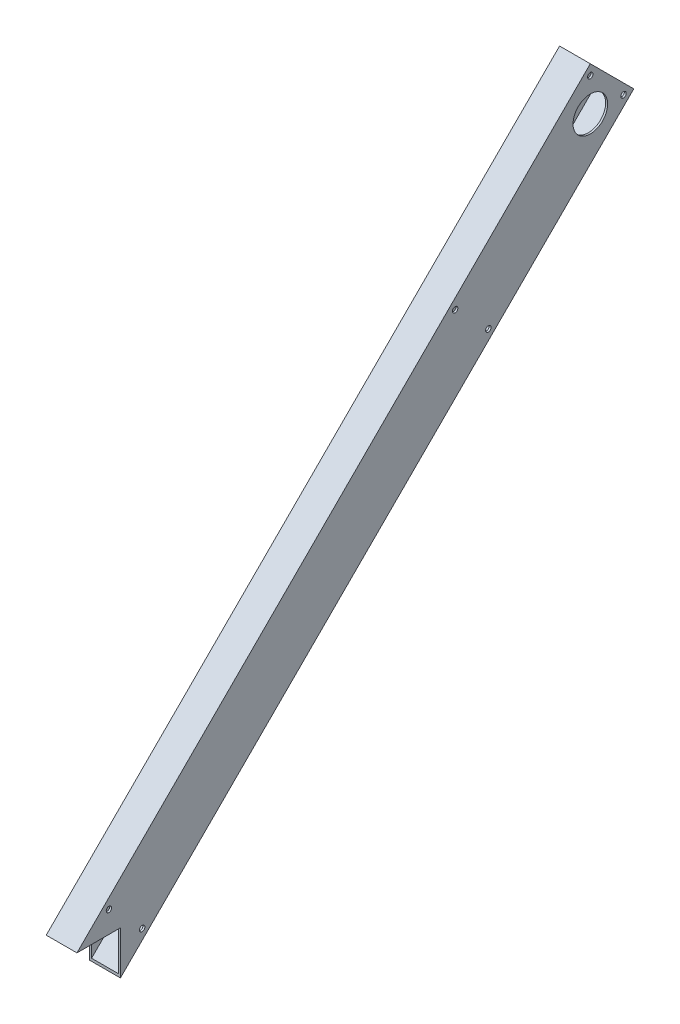
ISO-10303-21;
HEADER;
FILE_DESCRIPTION(('STEP AP214'),'2;1');
FILE_NAME('part.step','',(''),(''),'','','');
FILE_SCHEMA(('AUTOMOTIVE_DESIGN { 1 0 10303 214 1 1 1 1 }'));
ENDSEC;
DATA;
#1=APPLICATION_CONTEXT('core data for automotive mechanical design processes');
#2=APPLICATION_PROTOCOL_DEFINITION('international standard','automotive_design',2000,#1);
#3=PRODUCT_CONTEXT('',#1,'mechanical');
#4=PRODUCT('Part','Part','',(#3));
#5=PRODUCT_RELATED_PRODUCT_CATEGORY('part','',(#4));
#6=PRODUCT_DEFINITION_FORMATION('','',#4);
#7=PRODUCT_DEFINITION_CONTEXT('part definition',#1,'design');
#8=PRODUCT_DEFINITION('design','',#6,#7);
#9=PRODUCT_DEFINITION_SHAPE('','',#8);
#10=(LENGTH_UNIT() NAMED_UNIT(*) SI_UNIT(.MILLI.,.METRE.));
#11=(NAMED_UNIT(*) PLANE_ANGLE_UNIT() SI_UNIT($,.RADIAN.));
#12=(NAMED_UNIT(*) SI_UNIT($,.STERADIAN.) SOLID_ANGLE_UNIT());
#13=UNCERTAINTY_MEASURE_WITH_UNIT(LENGTH_MEASURE(1.E-05),#10,'distance_accuracy_value','');
#14=(GEOMETRIC_REPRESENTATION_CONTEXT(3) GLOBAL_UNCERTAINTY_ASSIGNED_CONTEXT((#13)) GLOBAL_UNIT_ASSIGNED_CONTEXT((#10,
#11,#12)) REPRESENTATION_CONTEXT('',''));
#15=CARTESIAN_POINT('',(0.,0.,0.));
#16=DIRECTION('',(0.,0.,1.));
#17=DIRECTION('',(1.,0.,0.));
#18=AXIS2_PLACEMENT_3D('',#15,#16,#17);
#19=CARTESIAN_POINT('',(101.6,25.3999999999999,-118.678975515723));
#20=DIRECTION('',(1.,0.,0.));
#21=DIRECTION('',(0.,1.,0.));
#22=AXIS2_PLACEMENT_3D('',#19,#20,#21);
#23=PLANE('',#22);
#24=CARTESIAN_POINT('',(101.6,302.020172800175,-458.655915910218));
#25=DIRECTION('',(1.,0.,0.));
#26=DIRECTION('',(0.,1.,0.));
#27=AXIS2_PLACEMENT_3D('',#24,#25,#26);
#28=CIRCLE('',#27,2.25000000000001);
#29=CARTESIAN_POINT('',(101.6,304.270172800175,-458.655915910218));
#30=VERTEX_POINT('',#29);
#31=EDGE_CURVE('E137',#30,#30,#28,.T.);
#32=ORIENTED_EDGE('',*,*,#31,.F.);
#33=EDGE_LOOP('',(#32));
#34=FACE_BOUND('',#33,.T.);
#35=CARTESIAN_POINT('',(101.6,329.455915910215,-431.220172800177));
#36=DIRECTION('',(1.,0.,0.));
#37=DIRECTION('',(0.,1.,0.));
#38=AXIS2_PLACEMENT_3D('',#35,#36,#37);
#39=CIRCLE('',#38,2.25000000000001);
#40=CARTESIAN_POINT('',(101.6,331.705915910215,-431.220172800177));
#41=VERTEX_POINT('',#40);
#42=EDGE_CURVE('E140',#41,#41,#39,.T.);
#43=ORIENTED_EDGE('',*,*,#42,.F.);
#44=EDGE_LOOP('',(#43));
#45=FACE_BOUND('',#44,.T.);
#46=CARTESIAN_POINT('',(101.6,413.74304422765,-570.378787337692));
#47=DIRECTION('',(1.,0.,0.));
#48=DIRECTION('',(0.,1.,0.));
#49=AXIS2_PLACEMENT_3D('',#46,#47,#48);
#50=CIRCLE('',#49,2.25000000000001);
#51=CARTESIAN_POINT('',(101.6,415.99304422765,-570.378787337692));
#52=VERTEX_POINT('',#51);
#53=EDGE_CURVE('E300',#52,#52,#50,.T.);
#54=ORIENTED_EDGE('',*,*,#53,.F.);
#55=EDGE_LOOP('',(#54));
#56=FACE_BOUND('',#55,.T.);
#57=CARTESIAN_POINT('',(101.6,441.17878733769,-542.943044227652));
#58=DIRECTION('',(1.,0.,0.));
#59=DIRECTION('',(0.,1.,0.));
#60=AXIS2_PLACEMENT_3D('',#57,#58,#59);
#61=CIRCLE('',#60,2.25000000000001);
#62=CARTESIAN_POINT('',(101.6,443.42878733769,-542.943044227652));
#63=VERTEX_POINT('',#62);
#64=EDGE_CURVE('E143',#63,#63,#61,.T.);
#65=ORIENTED_EDGE('',*,*,#64,.F.);
#66=EDGE_LOOP('',(#65));
#67=FACE_BOUND('',#66,.T.);
#68=CARTESIAN_POINT('',(101.6,413.74304422765,-542.943044227654));
#69=DIRECTION('',(1.,0.,0.));
#70=DIRECTION('',(0.,1.,0.));
#71=AXIS2_PLACEMENT_3D('',#68,#69,#70);
#72=CIRCLE('',#71,14.2875);
#73=CARTESIAN_POINT('',(101.6,428.03054422765,-542.943044227654));
#74=VERTEX_POINT('',#73);
#75=EDGE_CURVE('E307',#74,#74,#72,.T.);
#76=ORIENTED_EDGE('',*,*,#75,.F.);
#77=EDGE_LOOP('',(#76));
#78=FACE_BOUND('',#77,.T.);
#79=CARTESIAN_POINT('',(101.6,15.9247691320981,-172.560512242141));
#80=DIRECTION('',(1.,0.,0.));
#81=DIRECTION('',(0.,1.,0.));
#82=AXIS2_PLACEMENT_3D('',#79,#80,#81);
#83=CIRCLE('',#82,2.25000000000001);
#84=CARTESIAN_POINT('',(101.6,18.1747691320981,-172.560512242141));
#85=VERTEX_POINT('',#84);
#86=EDGE_CURVE('E311',#85,#85,#83,.T.);
#87=ORIENTED_EDGE('',*,*,#86,.F.);
#88=EDGE_LOOP('',(#87));
#89=FACE_BOUND('',#88,.T.);
#90=CARTESIAN_POINT('',(101.6,43.3605122421383,-145.1247691321));
#91=DIRECTION('',(1.,0.,0.));
#92=DIRECTION('',(0.,1.,0.));
#93=AXIS2_PLACEMENT_3D('',#90,#91,#92);
#94=CIRCLE('',#93,2.25000000000001);
#95=CARTESIAN_POINT('',(101.6,45.6105122421383,-145.1247691321));
#96=VERTEX_POINT('',#95);
#97=EDGE_CURVE('E314',#96,#96,#94,.T.);
#98=ORIENTED_EDGE('',*,*,#97,.F.);
#99=EDGE_LOOP('',(#98));
#100=FACE_BOUND('',#99,.T.);
#101=DIRECTION('',(0.,0.,1.));
#102=VECTOR('',#101,1.);
#103=CARTESIAN_POINT('',(101.6,25.4,25.4));
#104=LINE('',#103,#102);
#105=CARTESIAN_POINT('',(101.6,25.4000000000006,-154.6));
#106=VERTEX_POINT('',#105);
#107=CARTESIAN_POINT('',(101.6,25.4000000000005,-118.678975515723));
#108=VERTEX_POINT('',#107);
#109=EDGE_CURVE('E120',#106,#108,#104,.T.);
#110=ORIENTED_EDGE('',*,*,#109,.F.);
#111=DIRECTION('',(0.,1.,0.));
#112=VECTOR('',#111,1.);
#113=CARTESIAN_POINT('',(101.6,25.4000000000006,-154.6));
#114=LINE('',#113,#112);
#115=CARTESIAN_POINT('',(101.6,-10.5210244842772,-154.6));
#116=VERTEX_POINT('',#115);
#117=EDGE_CURVE('E125',#116,#106,#114,.T.);
#118=ORIENTED_EDGE('',*,*,#117,.F.);
#119=DIRECTION('',(0.,0.707106781186544,-0.707106781186551));
#120=VECTOR('',#119,1.);
#121=CARTESIAN_POINT('',(101.6,-10.5210244842769,-154.6));
#122=LINE('',#121,#120);
#123=CARTESIAN_POINT('',(101.6,413.74304422765,-578.86406871193));
#124=VERTEX_POINT('',#123);
#125=EDGE_CURVE('E228',#116,#124,#122,.T.);
#126=ORIENTED_EDGE('',*,*,#125,.T.);
#127=DIRECTION('',(0.,-0.70710678118655,-0.707106781186545));
#128=VECTOR('',#127,1.);
#129=CARTESIAN_POINT('',(101.6,449.664068711927,-542.943044227654));
#130=LINE('',#129,#128);
#131=CARTESIAN_POINT('',(101.6,449.664068711927,-542.943044227654));
#132=VERTEX_POINT('',#131);
#133=EDGE_CURVE('E218',#132,#124,#130,.T.);
#134=ORIENTED_EDGE('',*,*,#133,.F.);
#135=DIRECTION('',(0.,0.707106781186544,-0.707106781186551));
#136=VECTOR('',#135,1.);
#137=CARTESIAN_POINT('',(101.6,25.3999999999999,-118.678975515723));
#138=LINE('',#137,#136);
#139=EDGE_CURVE('E135',#108,#132,#138,.T.);
#140=ORIENTED_EDGE('',*,*,#139,.F.);
#141=EDGE_LOOP('',(#110,#118,#126,#134,#140));
#142=FACE_BOUND('',#141,.T.);
#143=ADVANCED_FACE('F38',(#34,#45,#56,#67,#78,#89,#100,#142),#23,.T.);
#144=CARTESIAN_POINT('',(101.6,25.3999999999999,-118.678975515723));
#145=DIRECTION('',(0.,0.707106781186551,0.707106781186544));
#146=DIRECTION('',(0.,-0.707106781186544,0.707106781186551));
#147=AXIS2_PLACEMENT_3D('',#144,#145,#146);
#148=PLANE('',#147);
#149=DIRECTION('',(1.,0.,0.));
#150=VECTOR('',#149,1.);
#151=CARTESIAN_POINT('',(101.6,449.664068711927,-542.943044227654));
#152=LINE('',#151,#150);
#153=CARTESIAN_POINT('',(76.2,449.664068711927,-542.943044227654));
#154=VERTEX_POINT('',#153);
#155=EDGE_CURVE('E226',#154,#132,#152,.T.);
#156=ORIENTED_EDGE('',*,*,#155,.F.);
#157=DIRECTION('',(0.,0.707106781186544,-0.707106781186551));
#158=VECTOR('',#157,1.);
#159=CARTESIAN_POINT('',(76.2,25.3999999999999,-118.678975515723));
#160=LINE('',#159,#158);
#161=CARTESIAN_POINT('',(76.2,25.4000000000005,-118.678975515723));
#162=VERTEX_POINT('',#161);
#163=EDGE_CURVE('E240',#162,#154,#160,.T.);
#164=ORIENTED_EDGE('',*,*,#163,.F.);
#165=DIRECTION('',(1.,0.,0.));
#166=VECTOR('',#165,1.);
#167=CARTESIAN_POINT('',(101.6,25.3999999999999,-118.678975515723));
#168=LINE('',#167,#166);
#169=EDGE_CURVE('E225',#162,#108,#168,.T.);
#170=ORIENTED_EDGE('',*,*,#169,.T.);
#171=ORIENTED_EDGE('',*,*,#139,.T.);
#172=EDGE_LOOP('',(#156,#164,#170,#171));
#173=FACE_BOUND('',#172,.T.);
#174=ADVANCED_FACE('F283',(#173),#148,.T.);
#175=CARTESIAN_POINT('',(76.2,25.3999999999999,-118.678975515723));
#176=DIRECTION('',(-1.,0.,0.));
#177=DIRECTION('',(0.,-1.,0.));
#178=AXIS2_PLACEMENT_3D('',#175,#176,#177);
#179=PLANE('',#178);
#180=CARTESIAN_POINT('',(76.2,302.020172800175,-458.655915910218));
#181=DIRECTION('',(-1.,0.,0.));
#182=DIRECTION('',(0.,-1.,0.));
#183=AXIS2_PLACEMENT_3D('',#180,#181,#182);
#184=CIRCLE('',#183,2.25000000000001);
#185=CARTESIAN_POINT('',(76.2,299.770172800175,-458.655915910218));
#186=VERTEX_POINT('',#185);
#187=EDGE_CURVE('E203',#186,#186,#184,.T.);
#188=ORIENTED_EDGE('',*,*,#187,.F.);
#189=EDGE_LOOP('',(#188));
#190=FACE_BOUND('',#189,.T.);
#191=CARTESIAN_POINT('',(76.2,329.455915910215,-431.220172800177));
#192=DIRECTION('',(-1.,0.,0.));
#193=DIRECTION('',(0.,-1.,0.));
#194=AXIS2_PLACEMENT_3D('',#191,#192,#193);
#195=CIRCLE('',#194,2.25000000000001);
#196=CARTESIAN_POINT('',(76.2,327.205915910215,-431.220172800177));
#197=VERTEX_POINT('',#196);
#198=EDGE_CURVE('E197',#197,#197,#195,.T.);
#199=ORIENTED_EDGE('',*,*,#198,.F.);
#200=EDGE_LOOP('',(#199));
#201=FACE_BOUND('',#200,.T.);
#202=CARTESIAN_POINT('',(76.2,413.74304422765,-570.378787337692));
#203=DIRECTION('',(-1.,0.,0.));
#204=DIRECTION('',(0.,-1.,0.));
#205=AXIS2_PLACEMENT_3D('',#202,#203,#204);
#206=CIRCLE('',#205,2.25000000000001);
#207=CARTESIAN_POINT('',(76.2,411.49304422765,-570.378787337692));
#208=VERTEX_POINT('',#207);
#209=EDGE_CURVE('E190',#208,#208,#206,.T.);
#210=ORIENTED_EDGE('',*,*,#209,.F.);
#211=EDGE_LOOP('',(#210));
#212=FACE_BOUND('',#211,.T.);
#213=CARTESIAN_POINT('',(76.2,441.17878733769,-542.943044227652));
#214=DIRECTION('',(-1.,0.,0.));
#215=DIRECTION('',(0.,-1.,0.));
#216=AXIS2_PLACEMENT_3D('',#213,#214,#215);
#217=CIRCLE('',#216,2.25000000000001);
#218=CARTESIAN_POINT('',(76.2,438.92878733769,-542.943044227652));
#219=VERTEX_POINT('',#218);
#220=EDGE_CURVE('E183',#219,#219,#217,.T.);
#221=ORIENTED_EDGE('',*,*,#220,.F.);
#222=EDGE_LOOP('',(#221));
#223=FACE_BOUND('',#222,.T.);
#224=CARTESIAN_POINT('',(76.2,413.74304422765,-542.943044227654));
#225=DIRECTION('',(-1.,0.,0.));
#226=DIRECTION('',(0.,-1.,0.));
#227=AXIS2_PLACEMENT_3D('',#224,#225,#226);
#228=CIRCLE('',#227,14.2875);
#229=CARTESIAN_POINT('',(76.2,399.45554422765,-542.943044227654));
#230=VERTEX_POINT('',#229);
#231=EDGE_CURVE('E176',#230,#230,#228,.T.);
#232=ORIENTED_EDGE('',*,*,#231,.F.);
#233=EDGE_LOOP('',(#232));
#234=FACE_BOUND('',#233,.T.);
#235=CARTESIAN_POINT('',(76.2,15.9247691320981,-172.560512242141));
#236=DIRECTION('',(-1.,0.,0.));
#237=DIRECTION('',(0.,-1.,0.));
#238=AXIS2_PLACEMENT_3D('',#235,#236,#237);
#239=CIRCLE('',#238,2.25000000000001);
#240=CARTESIAN_POINT('',(76.2,13.6747691320981,-172.560512242141));
#241=VERTEX_POINT('',#240);
#242=EDGE_CURVE('E169',#241,#241,#239,.T.);
#243=ORIENTED_EDGE('',*,*,#242,.F.);
#244=EDGE_LOOP('',(#243));
#245=FACE_BOUND('',#244,.T.);
#246=CARTESIAN_POINT('',(76.2,43.3605122421383,-145.1247691321));
#247=DIRECTION('',(-1.,0.,0.));
#248=DIRECTION('',(0.,-1.,0.));
#249=AXIS2_PLACEMENT_3D('',#246,#247,#248);
#250=CIRCLE('',#249,2.25000000000001);
#251=CARTESIAN_POINT('',(76.2,41.1105122421383,-145.1247691321));
#252=VERTEX_POINT('',#251);
#253=EDGE_CURVE('E162',#252,#252,#250,.T.);
#254=ORIENTED_EDGE('',*,*,#253,.F.);
#255=EDGE_LOOP('',(#254));
#256=FACE_BOUND('',#255,.T.);
#257=DIRECTION('',(0.,0.,-1.));
#258=VECTOR('',#257,1.);
#259=CARTESIAN_POINT('',(76.2,25.4000000000005,-118.678975515723));
#260=LINE('',#259,#258);
#261=CARTESIAN_POINT('',(76.2,25.4000000000006,-154.6));
#262=VERTEX_POINT('',#261);
#263=EDGE_CURVE('E156',#162,#262,#260,.T.);
#264=ORIENTED_EDGE('',*,*,#263,.F.);
#265=ORIENTED_EDGE('',*,*,#163,.T.);
#266=DIRECTION('',(0.,0.70710678118655,0.707106781186545));
#267=VECTOR('',#266,1.);
#268=CARTESIAN_POINT('',(76.2,449.664068711927,-542.943044227654));
#269=LINE('',#268,#267);
#270=CARTESIAN_POINT('',(76.2,413.74304422765,-578.86406871193));
#271=VERTEX_POINT('',#270);
#272=EDGE_CURVE('E234',#271,#154,#269,.T.);
#273=ORIENTED_EDGE('',*,*,#272,.F.);
#274=DIRECTION('',(0.,0.707106781186544,-0.707106781186551));
#275=VECTOR('',#274,1.);
#276=CARTESIAN_POINT('',(76.2,-10.5210244842769,-154.6));
#277=LINE('',#276,#275);
#278=CARTESIAN_POINT('',(76.2,-10.5210244842769,-154.6));
#279=VERTEX_POINT('',#278);
#280=EDGE_CURVE('E242',#279,#271,#277,.T.);
#281=ORIENTED_EDGE('',*,*,#280,.F.);
#282=DIRECTION('',(0.,-1.,0.));
#283=VECTOR('',#282,1.);
#284=CARTESIAN_POINT('',(76.2,25.3999999999999,-154.6));
#285=LINE('',#284,#283);
#286=EDGE_CURVE('E150',#262,#279,#285,.T.);
#287=ORIENTED_EDGE('',*,*,#286,.F.);
#288=EDGE_LOOP('',(#264,#265,#273,#281,#287));
#289=FACE_BOUND('',#288,.T.);
#290=ADVANCED_FACE('F289',(#190,#201,#212,#223,#234,#245,#256,#289),#179,.T.);
#291=CARTESIAN_POINT('',(101.6,-10.5210244842769,-154.6));
#292=DIRECTION('',(0.,-0.707106781186551,-0.707106781186544));
#293=DIRECTION('',(0.,0.707106781186544,-0.707106781186551));
#294=AXIS2_PLACEMENT_3D('',#291,#292,#293);
#295=PLANE('',#294);
#296=DIRECTION('',(-1.,0.,0.));
#297=VECTOR('',#296,1.);
#298=CARTESIAN_POINT('',(101.6,413.74304422765,-578.86406871193));
#299=LINE('',#298,#297);
#300=EDGE_CURVE('E231',#124,#271,#299,.T.);
#301=ORIENTED_EDGE('',*,*,#300,.F.);
#302=ORIENTED_EDGE('',*,*,#125,.F.);
#303=DIRECTION('',(-1.,0.,0.));
#304=VECTOR('',#303,1.);
#305=CARTESIAN_POINT('',(101.6,-10.5210244842769,-154.6));
#306=LINE('',#305,#304);
#307=EDGE_CURVE('E130',#116,#279,#306,.T.);
#308=ORIENTED_EDGE('',*,*,#307,.T.);
#309=ORIENTED_EDGE('',*,*,#280,.T.);
#310=EDGE_LOOP('',(#301,#302,#308,#309));
#311=FACE_BOUND('',#310,.T.);
#312=ADVANCED_FACE('F365',(#311),#295,.T.);
#313=CARTESIAN_POINT('',(0.,496.303556469789,-496.303556469792));
#314=DIRECTION('',(0.,0.707106781186545,-0.70710678118655));
#315=DIRECTION('',(0.,0.70710678118655,0.707106781186545));
#316=AXIS2_PLACEMENT_3D('',#313,#314,#315);
#317=PLANE('',#316);
#318=DIRECTION('',(0.,-0.70710678118655,-0.707106781186545));
#319=VECTOR('',#318,1.);
#320=CARTESIAN_POINT('',(100.0125,448.541536696793,-544.065576242788));
#321=LINE('',#320,#319);
#322=CARTESIAN_POINT('',(100.0125,448.541536696793,-544.065576242788));
#323=VERTEX_POINT('',#322);
#324=CARTESIAN_POINT('',(100.0125,414.865576242784,-577.741536696797));
#325=VERTEX_POINT('',#324);
#326=EDGE_CURVE('E206',#323,#325,#321,.T.);
#327=ORIENTED_EDGE('',*,*,#326,.F.);
#328=DIRECTION('',(1.,0.,0.));
#329=VECTOR('',#328,1.);
#330=CARTESIAN_POINT('',(100.0125,448.541536696793,-544.065576242788));
#331=LINE('',#330,#329);
#332=CARTESIAN_POINT('',(77.7875,448.541536696793,-544.065576242788));
#333=VERTEX_POINT('',#332);
#334=EDGE_CURVE('E213',#333,#323,#331,.T.);
#335=ORIENTED_EDGE('',*,*,#334,.F.);
#336=DIRECTION('',(0.,0.70710678118655,0.707106781186545));
#337=VECTOR('',#336,1.);
#338=CARTESIAN_POINT('',(77.7875,448.541536696793,-544.065576242788));
#339=LINE('',#338,#337);
#340=CARTESIAN_POINT('',(77.7875,414.865576242784,-577.741536696797));
#341=VERTEX_POINT('',#340);
#342=EDGE_CURVE('E210',#341,#333,#339,.T.);
#343=ORIENTED_EDGE('',*,*,#342,.F.);
#344=DIRECTION('',(-1.,0.,0.));
#345=VECTOR('',#344,1.);
#346=CARTESIAN_POINT('',(100.0125,414.865576242784,-577.741536696797));
#347=LINE('',#346,#345);
#348=EDGE_CURVE('E208',#325,#341,#347,.T.);
#349=ORIENTED_EDGE('',*,*,#348,.F.);
#350=EDGE_LOOP('',(#327,#335,#343,#349));
#351=FACE_BOUND('',#350,.T.);
#352=ORIENTED_EDGE('',*,*,#133,.T.);
#353=ORIENTED_EDGE('',*,*,#300,.T.);
#354=ORIENTED_EDGE('',*,*,#272,.T.);
#355=ORIENTED_EDGE('',*,*,#155,.T.);
#356=EDGE_LOOP('',(#352,#353,#354,#355));
#357=FACE_BOUND('',#356,.T.);
#358=ADVANCED_FACE('F336',(#351,#357),#317,.T.);
#359=CARTESIAN_POINT('',(100.0125,24.2774679848662,-119.801507530857));
#360=DIRECTION('',(1.,0.,0.));
#361=DIRECTION('',(0.,0.,-1.));
#362=AXIS2_PLACEMENT_3D('',#359,#360,#361);
#363=PLANE('',#362);
#364=CARTESIAN_POINT('',(100.0125,302.020172800175,-458.655915910218));
#365=DIRECTION('',(1.,0.,0.));
#366=DIRECTION('',(0.,0.,-1.));
#367=AXIS2_PLACEMENT_3D('',#364,#365,#366);
#368=CIRCLE('',#367,2.25000000000001);
#369=CARTESIAN_POINT('',(100.0125,302.020172800175,-460.905915910218));
#370=VERTEX_POINT('',#369);
#371=EDGE_CURVE('E200',#370,#370,#368,.T.);
#372=ORIENTED_EDGE('',*,*,#371,.T.);
#373=EDGE_LOOP('',(#372));
#374=FACE_BOUND('',#373,.T.);
#375=CARTESIAN_POINT('',(100.0125,329.455915910215,-431.220172800177));
#376=DIRECTION('',(1.,0.,0.));
#377=DIRECTION('',(0.,0.,-1.));
#378=AXIS2_PLACEMENT_3D('',#375,#376,#377);
#379=CIRCLE('',#378,2.25000000000001);
#380=CARTESIAN_POINT('',(100.0125,329.455915910215,-433.470172800178));
#381=VERTEX_POINT('',#380);
#382=EDGE_CURVE('E194',#381,#381,#379,.T.);
#383=ORIENTED_EDGE('',*,*,#382,.T.);
#384=EDGE_LOOP('',(#383));
#385=FACE_BOUND('',#384,.T.);
#386=CARTESIAN_POINT('',(100.0125,413.74304422765,-570.378787337692));
#387=DIRECTION('',(1.,0.,0.));
#388=DIRECTION('',(0.,0.,-1.));
#389=AXIS2_PLACEMENT_3D('',#386,#387,#388);
#390=CIRCLE('',#389,2.25000000000001);
#391=CARTESIAN_POINT('',(100.0125,413.74304422765,-572.628787337692));
#392=VERTEX_POINT('',#391);
#393=EDGE_CURVE('E187',#392,#392,#390,.T.);
#394=ORIENTED_EDGE('',*,*,#393,.T.);
#395=EDGE_LOOP('',(#394));
#396=FACE_BOUND('',#395,.T.);
#397=CARTESIAN_POINT('',(100.0125,441.17878733769,-542.943044227652));
#398=DIRECTION('',(1.,0.,0.));
#399=DIRECTION('',(0.,0.,-1.));
#400=AXIS2_PLACEMENT_3D('',#397,#398,#399);
#401=CIRCLE('',#400,2.25000000000001);
#402=CARTESIAN_POINT('',(100.0125,441.17878733769,-545.193044227652));
#403=VERTEX_POINT('',#402);
#404=EDGE_CURVE('E180',#403,#403,#401,.T.);
#405=ORIENTED_EDGE('',*,*,#404,.T.);
#406=EDGE_LOOP('',(#405));
#407=FACE_BOUND('',#406,.T.);
#408=CARTESIAN_POINT('',(100.0125,413.74304422765,-542.943044227654));
#409=DIRECTION('',(1.,0.,0.));
#410=DIRECTION('',(0.,0.,-1.));
#411=AXIS2_PLACEMENT_3D('',#408,#409,#410);
#412=CIRCLE('',#411,14.2875);
#413=CARTESIAN_POINT('',(100.0125,413.74304422765,-557.230544227654));
#414=VERTEX_POINT('',#413);
#415=EDGE_CURVE('E173',#414,#414,#412,.T.);
#416=ORIENTED_EDGE('',*,*,#415,.T.);
#417=EDGE_LOOP('',(#416));
#418=FACE_BOUND('',#417,.T.);
#419=CARTESIAN_POINT('',(100.0125,15.9247691320981,-172.560512242141));
#420=DIRECTION('',(1.,0.,0.));
#421=DIRECTION('',(0.,0.,-1.));
#422=AXIS2_PLACEMENT_3D('',#419,#420,#421);
#423=CIRCLE('',#422,2.25000000000001);
#424=CARTESIAN_POINT('',(100.0125,15.9247691320981,-174.810512242141));
#425=VERTEX_POINT('',#424);
#426=EDGE_CURVE('E166',#425,#425,#423,.T.);
#427=ORIENTED_EDGE('',*,*,#426,.T.);
#428=EDGE_LOOP('',(#427));
#429=FACE_BOUND('',#428,.T.);
#430=CARTESIAN_POINT('',(100.0125,43.3605122421383,-145.1247691321));
#431=DIRECTION('',(1.,0.,0.));
#432=DIRECTION('',(0.,0.,-1.));
#433=AXIS2_PLACEMENT_3D('',#430,#431,#432);
#434=CIRCLE('',#433,2.25000000000001);
#435=CARTESIAN_POINT('',(100.0125,43.3605122421383,-147.3747691321));
#436=VERTEX_POINT('',#435);
#437=EDGE_CURVE('E159',#436,#436,#434,.T.);
#438=ORIENTED_EDGE('',*,*,#437,.T.);
#439=EDGE_LOOP('',(#438));
#440=FACE_BOUND('',#439,.T.);
#441=DIRECTION('',(0.,1.,0.));
#442=VECTOR('',#441,1.);
#443=CARTESIAN_POINT('',(100.0125,24.2774679848662,-154.6));
#444=LINE('',#443,#442);
#445=CARTESIAN_POINT('',(100.0125,-8.27596045400928,-154.6));
#446=VERTEX_POINT('',#445);
#447=CARTESIAN_POINT('',(100.0125,25.4000000000006,-154.6));
#448=VERTEX_POINT('',#447);
#449=EDGE_CURVE('E54',#446,#448,#444,.T.);
#450=ORIENTED_EDGE('',*,*,#449,.T.);
#451=DIRECTION('',(0.,0.,1.));
#452=VECTOR('',#451,1.);
#453=CARTESIAN_POINT('',(100.0125,25.4000000000005,-119.801507530857));
#454=LINE('',#453,#452);
#455=CARTESIAN_POINT('',(100.0125,25.4000000000005,-120.924039545991));
#456=VERTEX_POINT('',#455);
#457=EDGE_CURVE('E123',#448,#456,#454,.T.);
#458=ORIENTED_EDGE('',*,*,#457,.T.);
#459=DIRECTION('',(0.,0.707106781186544,-0.707106781186551));
#460=VECTOR('',#459,1.);
#461=CARTESIAN_POINT('',(100.0125,24.2774679848662,-119.801507530857));
#462=LINE('',#461,#460);
#463=EDGE_CURVE('E216',#456,#323,#462,.T.);
#464=ORIENTED_EDGE('',*,*,#463,.T.);
#465=ORIENTED_EDGE('',*,*,#326,.T.);
#466=DIRECTION('',(0.,0.707106781186544,-0.707106781186551));
#467=VECTOR('',#466,1.);
#468=CARTESIAN_POINT('',(100.0125,-9.39849246914321,-153.477467984866));
#469=LINE('',#468,#467);
#470=EDGE_CURVE('E61',#446,#325,#469,.T.);
#471=ORIENTED_EDGE('',*,*,#470,.F.);
#472=EDGE_LOOP('',(#450,#458,#464,#465,#471));
#473=FACE_BOUND('',#472,.T.);
#474=ADVANCED_FACE('F332',(#374,#385,#396,#407,#418,#429,#440,#473),#363,.F.);
#475=CARTESIAN_POINT('',(100.0125,24.2774679848662,-119.801507530857));
#476=DIRECTION('',(0.,0.707106781186551,0.707106781186544));
#477=DIRECTION('',(0.,-0.707106781186544,0.707106781186551));
#478=AXIS2_PLACEMENT_3D('',#475,#476,#477);
#479=PLANE('',#478);
#480=ORIENTED_EDGE('',*,*,#463,.F.);
#481=DIRECTION('',(-1.,0.,0.));
#482=VECTOR('',#481,1.);
#483=CARTESIAN_POINT('',(100.0125,25.4000000000005,-120.924039545991));
#484=LINE('',#483,#482);
#485=CARTESIAN_POINT('',(77.7875,25.4000000000005,-120.924039545991));
#486=VERTEX_POINT('',#485);
#487=EDGE_CURVE('E152',#456,#486,#484,.T.);
#488=ORIENTED_EDGE('',*,*,#487,.T.);
#489=DIRECTION('',(0.,0.707106781186544,-0.707106781186551));
#490=VECTOR('',#489,1.);
#491=CARTESIAN_POINT('',(77.7875,24.2774679848662,-119.801507530857));
#492=LINE('',#491,#490);
#493=EDGE_CURVE('E219',#486,#333,#492,.T.);
#494=ORIENTED_EDGE('',*,*,#493,.T.);
#495=ORIENTED_EDGE('',*,*,#334,.T.);
#496=EDGE_LOOP('',(#480,#488,#494,#495));
#497=FACE_BOUND('',#496,.T.);
#498=ADVANCED_FACE('F335',(#497),#479,.F.);
#499=CARTESIAN_POINT('',(77.7875,24.2774679848662,-119.801507530857));
#500=DIRECTION('',(-1.,0.,0.));
#501=DIRECTION('',(0.,0.,1.));
#502=AXIS2_PLACEMENT_3D('',#499,#500,#501);
#503=PLANE('',#502);
#504=CARTESIAN_POINT('',(77.7875,302.020172800175,-458.655915910218));
#505=DIRECTION('',(-1.,0.,0.));
#506=DIRECTION('',(0.,0.,1.));
#507=AXIS2_PLACEMENT_3D('',#504,#505,#506);
#508=CIRCLE('',#507,2.25000000000001);
#509=CARTESIAN_POINT('',(77.7875,302.020172800175,-456.405915910218));
#510=VERTEX_POINT('',#509);
#511=EDGE_CURVE('E41',#510,#510,#508,.T.);
#512=ORIENTED_EDGE('',*,*,#511,.T.);
#513=EDGE_LOOP('',(#512));
#514=FACE_BOUND('',#513,.T.);
#515=CARTESIAN_POINT('',(77.7875,329.455915910215,-431.220172800177));
#516=DIRECTION('',(-1.,0.,0.));
#517=DIRECTION('',(0.,0.,1.));
#518=AXIS2_PLACEMENT_3D('',#515,#516,#517);
#519=CIRCLE('',#518,2.25000000000001);
#520=CARTESIAN_POINT('',(77.7875,329.455915910215,-428.970172800177));
#521=VERTEX_POINT('',#520);
#522=EDGE_CURVE('E193',#521,#521,#519,.T.);
#523=ORIENTED_EDGE('',*,*,#522,.T.);
#524=EDGE_LOOP('',(#523));
#525=FACE_BOUND('',#524,.T.);
#526=CARTESIAN_POINT('',(77.7875,413.74304422765,-570.378787337692));
#527=DIRECTION('',(-1.,0.,0.));
#528=DIRECTION('',(0.,0.,1.));
#529=AXIS2_PLACEMENT_3D('',#526,#527,#528);
#530=CIRCLE('',#529,2.25000000000001);
#531=CARTESIAN_POINT('',(77.7875,413.74304422765,-568.128787337692));
#532=VERTEX_POINT('',#531);
#533=EDGE_CURVE('E186',#532,#532,#530,.T.);
#534=ORIENTED_EDGE('',*,*,#533,.T.);
#535=EDGE_LOOP('',(#534));
#536=FACE_BOUND('',#535,.T.);
#537=CARTESIAN_POINT('',(77.7875,441.17878733769,-542.943044227652));
#538=DIRECTION('',(-1.,0.,0.));
#539=DIRECTION('',(0.,0.,1.));
#540=AXIS2_PLACEMENT_3D('',#537,#538,#539);
#541=CIRCLE('',#540,2.25000000000001);
#542=CARTESIAN_POINT('',(77.7875,441.17878733769,-540.693044227652));
#543=VERTEX_POINT('',#542);
#544=EDGE_CURVE('E179',#543,#543,#541,.T.);
#545=ORIENTED_EDGE('',*,*,#544,.T.);
#546=EDGE_LOOP('',(#545));
#547=FACE_BOUND('',#546,.T.);
#548=CARTESIAN_POINT('',(77.7875,413.74304422765,-542.943044227654));
#549=DIRECTION('',(-1.,0.,0.));
#550=DIRECTION('',(0.,0.,1.));
#551=AXIS2_PLACEMENT_3D('',#548,#549,#550);
#552=CIRCLE('',#551,14.2875);
#553=CARTESIAN_POINT('',(77.7875,413.74304422765,-528.655544227654));
#554=VERTEX_POINT('',#553);
#555=EDGE_CURVE('E172',#554,#554,#552,.T.);
#556=ORIENTED_EDGE('',*,*,#555,.T.);
#557=EDGE_LOOP('',(#556));
#558=FACE_BOUND('',#557,.T.);
#559=CARTESIAN_POINT('',(77.7875,15.9247691320981,-172.560512242141));
#560=DIRECTION('',(-1.,0.,0.));
#561=DIRECTION('',(0.,0.,1.));
#562=AXIS2_PLACEMENT_3D('',#559,#560,#561);
#563=CIRCLE('',#562,2.25000000000001);
#564=CARTESIAN_POINT('',(77.7875,15.9247691320981,-170.310512242141));
#565=VERTEX_POINT('',#564);
#566=EDGE_CURVE('E165',#565,#565,#563,.T.);
#567=ORIENTED_EDGE('',*,*,#566,.T.);
#568=EDGE_LOOP('',(#567));
#569=FACE_BOUND('',#568,.T.);
#570=CARTESIAN_POINT('',(77.7875,43.3605122421383,-145.1247691321));
#571=DIRECTION('',(-1.,0.,0.));
#572=DIRECTION('',(0.,0.,1.));
#573=AXIS2_PLACEMENT_3D('',#570,#571,#572);
#574=CIRCLE('',#573,2.25000000000001);
#575=CARTESIAN_POINT('',(77.7875,43.3605122421383,-142.8747691321));
#576=VERTEX_POINT('',#575);
#577=EDGE_CURVE('E158',#576,#576,#574,.T.);
#578=ORIENTED_EDGE('',*,*,#577,.T.);
#579=EDGE_LOOP('',(#578));
#580=FACE_BOUND('',#579,.T.);
#581=ORIENTED_EDGE('',*,*,#493,.F.);
#582=DIRECTION('',(0.,0.,-1.));
#583=VECTOR('',#582,1.);
#584=CARTESIAN_POINT('',(77.7875,25.4000000000005,-119.801507530857));
#585=LINE('',#584,#583);
#586=CARTESIAN_POINT('',(77.7875,25.4000000000006,-154.6));
#587=VERTEX_POINT('',#586);
#588=EDGE_CURVE('E11',#486,#587,#585,.T.);
#589=ORIENTED_EDGE('',*,*,#588,.T.);
#590=DIRECTION('',(0.,-1.,0.));
#591=VECTOR('',#590,1.);
#592=CARTESIAN_POINT('',(77.7875,24.2774679848662,-154.6));
#593=LINE('',#592,#591);
#594=CARTESIAN_POINT('',(77.7875,-8.27596045400927,-154.6));
#595=VERTEX_POINT('',#594);
#596=EDGE_CURVE('E146',#587,#595,#593,.T.);
#597=ORIENTED_EDGE('',*,*,#596,.T.);
#598=DIRECTION('',(0.,0.707106781186544,-0.707106781186551));
#599=VECTOR('',#598,1.);
#600=CARTESIAN_POINT('',(77.7875,-9.39849246914321,-153.477467984866));
#601=LINE('',#600,#599);
#602=EDGE_CURVE('E221',#595,#341,#601,.T.);
#603=ORIENTED_EDGE('',*,*,#602,.T.);
#604=ORIENTED_EDGE('',*,*,#342,.T.);
#605=EDGE_LOOP('',(#581,#589,#597,#603,#604));
#606=FACE_BOUND('',#605,.T.);
#607=ADVANCED_FACE('F258',(#514,#525,#536,#547,#558,#569,#580,#606),#503,.F.);
#608=CARTESIAN_POINT('',(100.0125,-9.39849246914321,-153.477467984866));
#609=DIRECTION('',(0.,-0.707106781186551,-0.707106781186544));
#610=DIRECTION('',(0.,0.707106781186544,-0.707106781186551));
#611=AXIS2_PLACEMENT_3D('',#608,#609,#610);
#612=PLANE('',#611);
#613=ORIENTED_EDGE('',*,*,#602,.F.);
#614=DIRECTION('',(1.,0.,0.));
#615=VECTOR('',#614,1.);
#616=CARTESIAN_POINT('',(100.0125,-8.27596045400928,-154.6));
#617=LINE('',#616,#615);
#618=EDGE_CURVE('E46',#595,#446,#617,.T.);
#619=ORIENTED_EDGE('',*,*,#618,.T.);
#620=ORIENTED_EDGE('',*,*,#470,.T.);
#621=ORIENTED_EDGE('',*,*,#348,.T.);
#622=EDGE_LOOP('',(#613,#619,#620,#621));
#623=FACE_BOUND('',#622,.T.);
#624=ADVANCED_FACE('F351',(#623),#612,.F.);
#625=CARTESIAN_POINT('',(1.59999999999995,25.4,25.4));
#626=DIRECTION('',(0.,1.,0.));
#627=DIRECTION('',(0.,0.,1.));
#628=AXIS2_PLACEMENT_3D('',#625,#626,#627);
#629=PLANE('',#628);
#630=ORIENTED_EDGE('',*,*,#263,.T.);
#631=DIRECTION('',(1.,0.,0.));
#632=VECTOR('',#631,1.);
#633=CARTESIAN_POINT('',(1.59999999999999,25.4000000000006,-154.6));
#634=LINE('',#633,#632);
#635=EDGE_CURVE('E124',#262,#587,#634,.T.);
#636=ORIENTED_EDGE('',*,*,#635,.T.);
#637=ORIENTED_EDGE('',*,*,#588,.F.);
#638=ORIENTED_EDGE('',*,*,#487,.F.);
#639=ORIENTED_EDGE('',*,*,#457,.F.);
#640=EDGE_CURVE('E116',#448,#106,#634,.T.);
#641=ORIENTED_EDGE('',*,*,#640,.T.);
#642=ORIENTED_EDGE('',*,*,#109,.T.);
#643=ORIENTED_EDGE('',*,*,#169,.F.);
#644=EDGE_LOOP('',(#630,#636,#637,#638,#639,#641,#642,#643));
#645=FACE_BOUND('',#644,.T.);
#646=ADVANCED_FACE('F118',(#645),#629,.F.);
#647=CARTESIAN_POINT('',(1.59999999999999,25.4000000000006,-154.6));
#648=DIRECTION('',(0.,0.,-1.));
#649=DIRECTION('',(-1.,0.,0.));
#650=AXIS2_PLACEMENT_3D('',#647,#648,#649);
#651=PLANE('',#650);
#652=ORIENTED_EDGE('',*,*,#286,.T.);
#653=ORIENTED_EDGE('',*,*,#307,.F.);
#654=ORIENTED_EDGE('',*,*,#117,.T.);
#655=ORIENTED_EDGE('',*,*,#640,.F.);
#656=ORIENTED_EDGE('',*,*,#449,.F.);
#657=ORIENTED_EDGE('',*,*,#618,.F.);
#658=ORIENTED_EDGE('',*,*,#596,.F.);
#659=ORIENTED_EDGE('',*,*,#635,.F.);
#660=EDGE_LOOP('',(#652,#653,#654,#655,#656,#657,#658,#659));
#661=FACE_BOUND('',#660,.T.);
#662=ADVANCED_FACE('F128',(#661),#651,.F.);
#663=CARTESIAN_POINT('',(1.59999999999998,43.3605122421383,-145.1247691321));
#664=DIRECTION('',(1.,0.,0.));
#665=DIRECTION('',(0.,1.,0.));
#666=AXIS2_PLACEMENT_3D('',#663,#664,#665);
#667=CYLINDRICAL_SURFACE('',#666,2.25000000000001);
#668=ORIENTED_EDGE('',*,*,#253,.T.);
#669=EDGE_LOOP('',(#668));
#670=FACE_BOUND('',#669,.T.);
#671=ORIENTED_EDGE('',*,*,#577,.F.);
#672=EDGE_LOOP('',(#671));
#673=FACE_BOUND('',#672,.T.);
#674=ADVANCED_FACE('F386',(#670,#673),#667,.F.);
#675=CARTESIAN_POINT('',(1.59999999999999,15.924769132098,-172.560512242141));
#676=DIRECTION('',(1.,0.,0.));
#677=DIRECTION('',(0.,1.,0.));
#678=AXIS2_PLACEMENT_3D('',#675,#676,#677);
#679=CYLINDRICAL_SURFACE('',#678,2.25000000000001);
#680=ORIENTED_EDGE('',*,*,#242,.T.);
#681=EDGE_LOOP('',(#680));
#682=FACE_BOUND('',#681,.T.);
#683=ORIENTED_EDGE('',*,*,#566,.F.);
#684=EDGE_LOOP('',(#683));
#685=FACE_BOUND('',#684,.T.);
#686=ADVANCED_FACE('F433',(#682,#685),#679,.F.);
#687=CARTESIAN_POINT('',(1.59999999999999,413.74304422765,-542.943044227654));
#688=DIRECTION('',(1.,0.,0.));
#689=DIRECTION('',(0.,1.,0.));
#690=AXIS2_PLACEMENT_3D('',#687,#688,#689);
#691=CYLINDRICAL_SURFACE('',#690,14.2875);
#692=ORIENTED_EDGE('',*,*,#231,.T.);
#693=EDGE_LOOP('',(#692));
#694=FACE_BOUND('',#693,.T.);
#695=ORIENTED_EDGE('',*,*,#555,.F.);
#696=EDGE_LOOP('',(#695));
#697=FACE_BOUND('',#696,.T.);
#698=ADVANCED_FACE('F329',(#694,#697),#691,.F.);
#699=CARTESIAN_POINT('',(1.59999999999998,441.17878733769,-542.943044227652));
#700=DIRECTION('',(1.,0.,0.));
#701=DIRECTION('',(0.,1.,0.));
#702=AXIS2_PLACEMENT_3D('',#699,#700,#701);
#703=CYLINDRICAL_SURFACE('',#702,2.25000000000001);
#704=ORIENTED_EDGE('',*,*,#220,.T.);
#705=EDGE_LOOP('',(#704));
#706=FACE_BOUND('',#705,.T.);
#707=ORIENTED_EDGE('',*,*,#544,.F.);
#708=EDGE_LOOP('',(#707));
#709=FACE_BOUND('',#708,.T.);
#710=ADVANCED_FACE('F276',(#706,#709),#703,.F.);
#711=CARTESIAN_POINT('',(1.59999999999999,413.74304422765,-570.378787337692));
#712=DIRECTION('',(1.,0.,0.));
#713=DIRECTION('',(0.,1.,0.));
#714=AXIS2_PLACEMENT_3D('',#711,#712,#713);
#715=CYLINDRICAL_SURFACE('',#714,2.25000000000001);
#716=ORIENTED_EDGE('',*,*,#209,.T.);
#717=EDGE_LOOP('',(#716));
#718=FACE_BOUND('',#717,.T.);
#719=ORIENTED_EDGE('',*,*,#533,.F.);
#720=EDGE_LOOP('',(#719));
#721=FACE_BOUND('',#720,.T.);
#722=ADVANCED_FACE('F264',(#718,#721),#715,.F.);
#723=CARTESIAN_POINT('',(1.59999999999998,329.455915910215,-431.220172800177));
#724=DIRECTION('',(1.,0.,0.));
#725=DIRECTION('',(0.,1.,0.));
#726=AXIS2_PLACEMENT_3D('',#723,#724,#725);
#727=CYLINDRICAL_SURFACE('',#726,2.25000000000001);
#728=ORIENTED_EDGE('',*,*,#198,.T.);
#729=EDGE_LOOP('',(#728));
#730=FACE_BOUND('',#729,.T.);
#731=ORIENTED_EDGE('',*,*,#522,.F.);
#732=EDGE_LOOP('',(#731));
#733=FACE_BOUND('',#732,.T.);
#734=ADVANCED_FACE('F261',(#730,#733),#727,.F.);
#735=CARTESIAN_POINT('',(1.59999999999999,302.020172800175,-458.655915910218));
#736=DIRECTION('',(1.,0.,0.));
#737=DIRECTION('',(0.,1.,0.));
#738=AXIS2_PLACEMENT_3D('',#735,#736,#737);
#739=CYLINDRICAL_SURFACE('',#738,2.25000000000001);
#740=ORIENTED_EDGE('',*,*,#187,.T.);
#741=EDGE_LOOP('',(#740));
#742=FACE_BOUND('',#741,.T.);
#743=ORIENTED_EDGE('',*,*,#511,.F.);
#744=EDGE_LOOP('',(#743));
#745=FACE_BOUND('',#744,.T.);
#746=ADVANCED_FACE('F263',(#742,#745),#739,.F.);
#747=ORIENTED_EDGE('',*,*,#97,.T.);
#748=EDGE_LOOP('',(#747));
#749=FACE_BOUND('',#748,.T.);
#750=ORIENTED_EDGE('',*,*,#437,.F.);
#751=EDGE_LOOP('',(#750));
#752=FACE_BOUND('',#751,.T.);
#753=ADVANCED_FACE('F272',(#749,#752),#667,.F.);
#754=ORIENTED_EDGE('',*,*,#86,.T.);
#755=EDGE_LOOP('',(#754));
#756=FACE_BOUND('',#755,.T.);
#757=ORIENTED_EDGE('',*,*,#426,.F.);
#758=EDGE_LOOP('',(#757));
#759=FACE_BOUND('',#758,.T.);
#760=ADVANCED_FACE('F327',(#756,#759),#679,.F.);
#761=ORIENTED_EDGE('',*,*,#75,.T.);
#762=EDGE_LOOP('',(#761));
#763=FACE_BOUND('',#762,.T.);
#764=ORIENTED_EDGE('',*,*,#415,.F.);
#765=EDGE_LOOP('',(#764));
#766=FACE_BOUND('',#765,.T.);
#767=ADVANCED_FACE('F323',(#763,#766),#691,.F.);
#768=ORIENTED_EDGE('',*,*,#64,.T.);
#769=EDGE_LOOP('',(#768));
#770=FACE_BOUND('',#769,.T.);
#771=ORIENTED_EDGE('',*,*,#404,.F.);
#772=EDGE_LOOP('',(#771));
#773=FACE_BOUND('',#772,.T.);
#774=ADVANCED_FACE('F326',(#770,#773),#703,.F.);
#775=ORIENTED_EDGE('',*,*,#53,.T.);
#776=EDGE_LOOP('',(#775));
#777=FACE_BOUND('',#776,.T.);
#778=ORIENTED_EDGE('',*,*,#393,.F.);
#779=EDGE_LOOP('',(#778));
#780=FACE_BOUND('',#779,.T.);
#781=ADVANCED_FACE('F279',(#777,#780),#715,.F.);
#782=ORIENTED_EDGE('',*,*,#42,.T.);
#783=EDGE_LOOP('',(#782));
#784=FACE_BOUND('',#783,.T.);
#785=ORIENTED_EDGE('',*,*,#382,.F.);
#786=EDGE_LOOP('',(#785));
#787=FACE_BOUND('',#786,.T.);
#788=ADVANCED_FACE('F267',(#784,#787),#727,.F.);
#789=ORIENTED_EDGE('',*,*,#31,.T.);
#790=EDGE_LOOP('',(#789));
#791=FACE_BOUND('',#790,.T.);
#792=ORIENTED_EDGE('',*,*,#371,.F.);
#793=EDGE_LOOP('',(#792));
#794=FACE_BOUND('',#793,.T.);
#795=ADVANCED_FACE('F275',(#791,#794),#739,.F.);
#796=CLOSED_SHELL('',(#143,#174,#290,#312,#358,#474,#498,#607,#624,#646,#662,#674,#686,#698,
#710,#722,#734,#746,#753,#760,#767,#774,#781,#788,#795));
#797=MANIFOLD_SOLID_BREP('B2',#796);
#798=ADVANCED_BREP_SHAPE_REPRESENTATION('',(#18,#797),#14);
#799=SHAPE_DEFINITION_REPRESENTATION(#9,#798);
ENDSEC;
END-ISO-10303-21;
